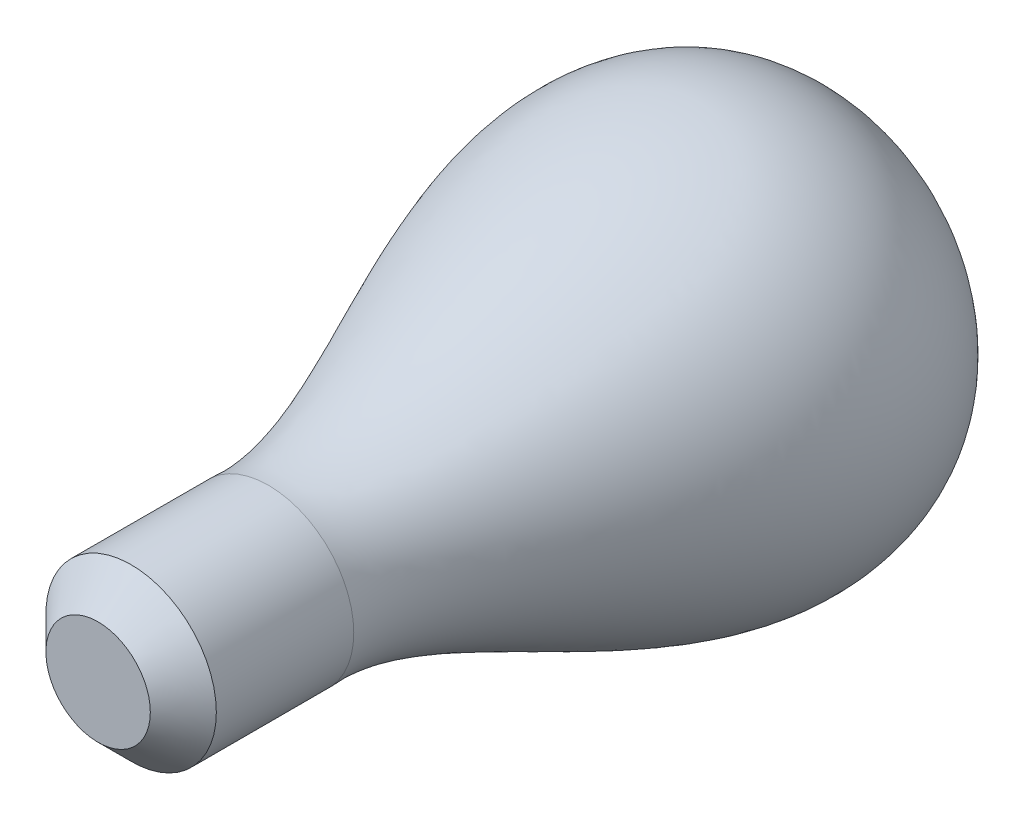
ISO-10303-21;
HEADER;
FILE_DESCRIPTION(('STEP AP214'),'2;1');
FILE_NAME('part.step','',(''),(''),'','','');
FILE_SCHEMA(('AUTOMOTIVE_DESIGN { 1 0 10303 214 1 1 1 1 }'));
ENDSEC;
DATA;
#1=APPLICATION_CONTEXT('core data for automotive mechanical design processes');
#2=APPLICATION_PROTOCOL_DEFINITION('international standard','automotive_design',2000,#1);
#3=PRODUCT_CONTEXT('',#1,'mechanical');
#4=PRODUCT('Part','Part','',(#3));
#5=PRODUCT_RELATED_PRODUCT_CATEGORY('part','',(#4));
#6=PRODUCT_DEFINITION_FORMATION('','',#4);
#7=PRODUCT_DEFINITION_CONTEXT('part definition',#1,'design');
#8=PRODUCT_DEFINITION('design','',#6,#7);
#9=PRODUCT_DEFINITION_SHAPE('','',#8);
#10=(LENGTH_UNIT() NAMED_UNIT(*) SI_UNIT(.MILLI.,.METRE.));
#11=(NAMED_UNIT(*) PLANE_ANGLE_UNIT() SI_UNIT($,.RADIAN.));
#12=(NAMED_UNIT(*) SI_UNIT($,.STERADIAN.) SOLID_ANGLE_UNIT());
#13=UNCERTAINTY_MEASURE_WITH_UNIT(LENGTH_MEASURE(1.E-05),#10,'distance_accuracy_value','');
#14=(GEOMETRIC_REPRESENTATION_CONTEXT(3) GLOBAL_UNCERTAINTY_ASSIGNED_CONTEXT((#13)) GLOBAL_UNIT_ASSIGNED_CONTEXT((#10,
#11,#12)) REPRESENTATION_CONTEXT('',''));
#15=CARTESIAN_POINT('',(0.,0.,0.));
#16=DIRECTION('',(0.,0.,1.));
#17=DIRECTION('',(1.,0.,0.));
#18=AXIS2_PLACEMENT_3D('',#15,#16,#17);
#19=CARTESIAN_POINT('',(0.,0.,25.4));
#20=DIRECTION('',(0.,0.,-1.));
#21=DIRECTION('',(-1.,0.,0.));
#22=AXIS2_PLACEMENT_3D('',#19,#20,#21);
#23=CYLINDRICAL_SURFACE('',#22,12.7);
#24=CARTESIAN_POINT('',(0.,0.,20.48));
#25=DIRECTION('',(0.,0.,1.));
#26=DIRECTION('',(1.,0.,0.));
#27=AXIS2_PLACEMENT_3D('',#24,#25,#26);
#28=CIRCLE('',#27,12.7);
#29=CARTESIAN_POINT('',(12.7,0.,20.48));
#30=VERTEX_POINT('',#29);
#31=EDGE_CURVE('E11',#30,#30,#28,.F.);
#32=ORIENTED_EDGE('',*,*,#31,.T.);
#33=EDGE_LOOP('',(#32));
#34=FACE_BOUND('',#33,.T.);
#35=CARTESIAN_POINT('',(0.,0.,0.));
#36=DIRECTION('',(0.,0.,1.));
#37=DIRECTION('',(1.,0.,0.));
#38=AXIS2_PLACEMENT_3D('',#35,#36,#37);
#39=CIRCLE('',#38,12.7);
#40=CARTESIAN_POINT('',(12.7,0.,0.));
#41=VERTEX_POINT('',#40);
#42=EDGE_CURVE('E70',#41,#41,#39,.T.);
#43=ORIENTED_EDGE('',*,*,#42,.T.);
#44=EDGE_LOOP('',(#43));
#45=FACE_BOUND('',#44,.T.);
#46=ADVANCED_FACE('F38',(#34,#45),#23,.T.);
#47=CARTESIAN_POINT('',(0.,0.,25.4));
#48=DIRECTION('',(0.,0.,1.));
#49=DIRECTION('',(1.,0.,0.));
#50=AXIS2_PLACEMENT_3D('',#47,#48,#49);
#51=PLANE('',#50);
#52=CARTESIAN_POINT('',(0.,0.,25.4));
#53=DIRECTION('',(0.,0.,1.));
#54=DIRECTION('',(1.,0.,0.));
#55=AXIS2_PLACEMENT_3D('',#52,#53,#54);
#56=CIRCLE('',#55,7.77999999999998);
#57=CARTESIAN_POINT('',(7.77999999999998,0.,25.4));
#58=VERTEX_POINT('',#57);
#59=EDGE_CURVE('E46',#58,#58,#56,.T.);
#60=ORIENTED_EDGE('',*,*,#59,.T.);
#61=EDGE_LOOP('',(#60));
#62=FACE_BOUND('',#61,.T.);
#63=ADVANCED_FACE('F51',(#62),#51,.T.);
#64=CARTESIAN_POINT('',(0.,0.,-91.44));
#65=CARTESIAN_POINT('',(-22.3132974316599,0.,-89.8694721388138));
#66=CARTESIAN_POINT('',(-44.0304804884102,0.,-54.7768489142704));
#67=CARTESIAN_POINT('',(-11.1288780317626,0.,-19.0357512871351));
#68=CARTESIAN_POINT('',(-12.7,0.,0.));
#69=B_SPLINE_CURVE_WITH_KNOTS('',3,(#64,#65,#66,#67,#68),.UNSPECIFIED.,.F.,.F.,(4,1,4),(0.,
0.356051470550162,1.),.UNSPECIFIED.);
#70=CARTESIAN_POINT('',(0.,0.,0.));
#71=DIRECTION('',(0.,0.,1.));
#72=AXIS1_PLACEMENT('',#70,#71);
#73=SURFACE_OF_REVOLUTION('',#69,#72);
#74=ORIENTED_EDGE('',*,*,#42,.F.);
#75=EDGE_LOOP('',(#74));
#76=FACE_BOUND('',#75,.T.);
#77=CARTESIAN_POINT('',(0.,0.,-91.44));
#78=VERTEX_POINT('',#77);
#79=VERTEX_LOOP('',#78);
#80=FACE_BOUND('',#79,.T.);
#81=ADVANCED_FACE('F49',(#76,#80),#73,.T.);
#82=CARTESIAN_POINT('',(0.,0.,25.4));
#83=DIRECTION('',(0.,0.,-1.));
#84=DIRECTION('',(-1.,0.,0.));
#85=AXIS2_PLACEMENT_3D('',#82,#83,#84);
#86=CONICAL_SURFACE('',#85,7.77999999999998,0.785398163397447);
#87=ORIENTED_EDGE('',*,*,#31,.F.);
#88=EDGE_LOOP('',(#87));
#89=FACE_BOUND('',#88,.T.);
#90=ORIENTED_EDGE('',*,*,#59,.F.);
#91=EDGE_LOOP('',(#90));
#92=FACE_BOUND('',#91,.T.);
#93=ADVANCED_FACE('F41',(#89,#92),#86,.T.);
#94=CLOSED_SHELL('',(#46,#63,#81,#93));
#95=MANIFOLD_SOLID_BREP('B2',#94);
#96=ADVANCED_BREP_SHAPE_REPRESENTATION('',(#18,#95),#14);
#97=SHAPE_DEFINITION_REPRESENTATION(#9,#96);
ENDSEC;
END-ISO-10303-21;
